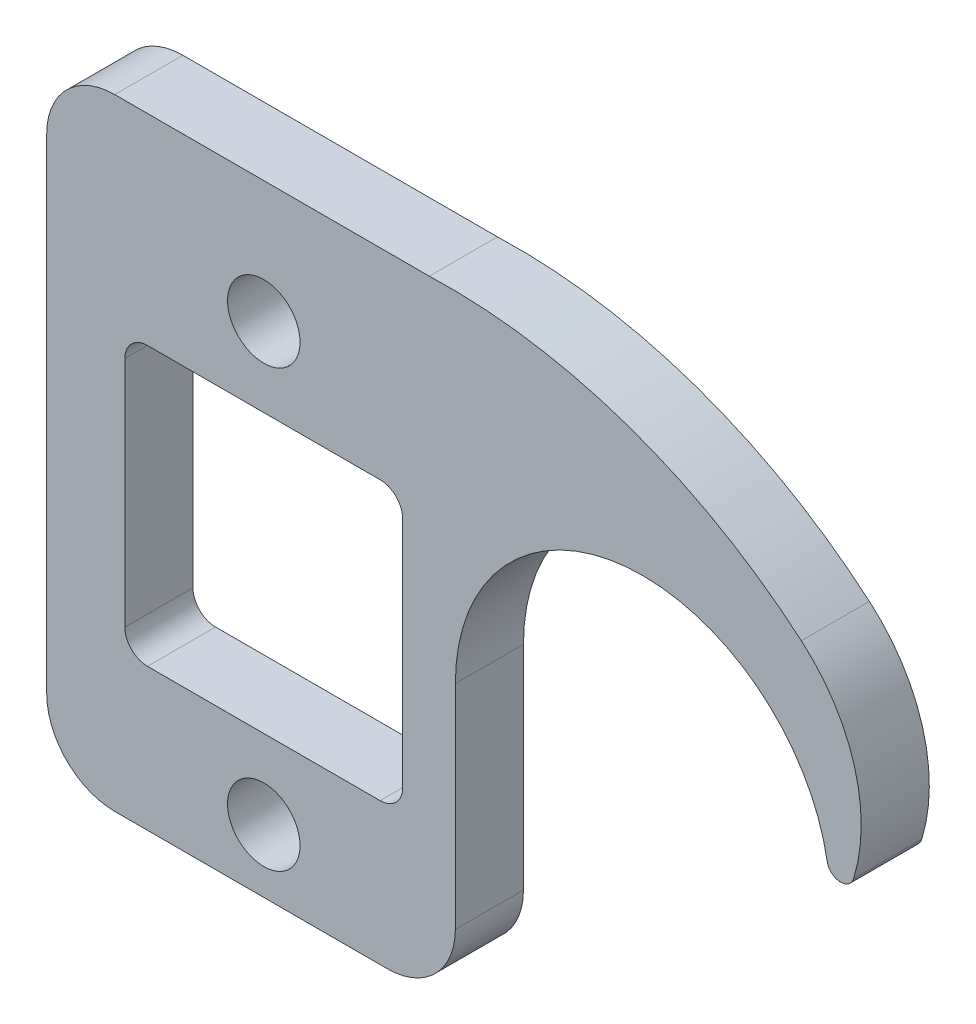
ISO-10303-21;
HEADER;
FILE_DESCRIPTION(('STEP AP214'),'2;1');
FILE_NAME('part.step','',(''),(''),'','','');
FILE_SCHEMA(('AUTOMOTIVE_DESIGN { 1 0 10303 214 1 1 1 1 }'));
ENDSEC;
DATA;
#1=APPLICATION_CONTEXT('core data for automotive mechanical design processes');
#2=APPLICATION_PROTOCOL_DEFINITION('international standard','automotive_design',2000,#1);
#3=PRODUCT_CONTEXT('',#1,'mechanical');
#4=PRODUCT('Part','Part','',(#3));
#5=PRODUCT_RELATED_PRODUCT_CATEGORY('part','',(#4));
#6=PRODUCT_DEFINITION_FORMATION('','',#4);
#7=PRODUCT_DEFINITION_CONTEXT('part definition',#1,'design');
#8=PRODUCT_DEFINITION('design','',#6,#7);
#9=PRODUCT_DEFINITION_SHAPE('','',#8);
#10=(LENGTH_UNIT() NAMED_UNIT(*) SI_UNIT(.MILLI.,.METRE.));
#11=(NAMED_UNIT(*) PLANE_ANGLE_UNIT() SI_UNIT($,.RADIAN.));
#12=(NAMED_UNIT(*) SI_UNIT($,.STERADIAN.) SOLID_ANGLE_UNIT());
#13=UNCERTAINTY_MEASURE_WITH_UNIT(LENGTH_MEASURE(1.E-05),#10,'distance_accuracy_value','');
#14=(GEOMETRIC_REPRESENTATION_CONTEXT(3) GLOBAL_UNCERTAINTY_ASSIGNED_CONTEXT((#13)) GLOBAL_UNIT_ASSIGNED_CONTEXT((#10,
#11,#12)) REPRESENTATION_CONTEXT('',''));
#15=CARTESIAN_POINT('',(0.,0.,0.));
#16=DIRECTION('',(0.,0.,1.));
#17=DIRECTION('',(1.,0.,0.));
#18=AXIS2_PLACEMENT_3D('',#15,#16,#17);
#19=CARTESIAN_POINT('',(-18.1389450946709,-19.0842207006165,94.2981249582492));
#20=DIRECTION('',(0.,0.,-1.));
#21=DIRECTION('',(-1.,0.,0.));
#22=AXIS2_PLACEMENT_3D('',#19,#20,#21);
#23=CYLINDRICAL_SURFACE('',#22,50.8);
#24=CARTESIAN_POINT('',(-18.1389450946709,-19.0842207006165,-3.175));
#25=DIRECTION('',(0.,0.,1.));
#26=DIRECTION('',(1.,0.,0.));
#27=AXIS2_PLACEMENT_3D('',#24,#25,#26);
#28=CIRCLE('',#27,50.8);
#29=CARTESIAN_POINT('',(14.7930990556582,19.595495793701,-3.175));
#30=VERTEX_POINT('',#29);
#31=CARTESIAN_POINT('',(-19.8857253584482,31.6857385145541,-3.175));
#32=VERTEX_POINT('',#31);
#33=EDGE_CURVE('E280',#30,#32,#28,.T.);
#34=ORIENTED_EDGE('',*,*,#33,.T.);
#35=DIRECTION('',(0.,0.,-1.));
#36=VECTOR('',#35,1.);
#37=CARTESIAN_POINT('',(-19.8857253584483,31.6857385145541,43.5889891098006));
#38=LINE('',#37,#36);
#39=CARTESIAN_POINT('',(-19.8857253584482,31.6857385145541,3.175));
#40=VERTEX_POINT('',#39);
#41=EDGE_CURVE('E355',#40,#32,#38,.T.);
#42=ORIENTED_EDGE('',*,*,#41,.F.);
#43=CARTESIAN_POINT('',(-18.1389450946709,-19.0842207006165,3.175));
#44=DIRECTION('',(0.,0.,1.));
#45=DIRECTION('',(1.,0.,0.));
#46=AXIS2_PLACEMENT_3D('',#43,#44,#45);
#47=CIRCLE('',#46,50.8);
#48=CARTESIAN_POINT('',(14.7930990556582,19.595495793701,3.175));
#49=VERTEX_POINT('',#48);
#50=EDGE_CURVE('E276',#40,#49,#47,.F.);
#51=ORIENTED_EDGE('',*,*,#50,.T.);
#52=DIRECTION('',(0.,0.,-1.));
#53=VECTOR('',#52,1.);
#54=CARTESIAN_POINT('',(14.7930990556582,19.595495793701,94.2981249582492));
#55=LINE('',#54,#53);
#56=EDGE_CURVE('E274',#49,#30,#55,.T.);
#57=ORIENTED_EDGE('',*,*,#56,.T.);
#58=EDGE_LOOP('',(#34,#42,#51,#57));
#59=FACE_BOUND('',#58,.T.);
#60=ADVANCED_FACE('F37',(#59),#23,.T.);
#61=CARTESIAN_POINT('',(4.50183525868039,7.5080843892268,3.175));
#62=DIRECTION('',(0.,0.,-1.));
#63=DIRECTION('',(-1.,0.,0.));
#64=AXIS2_PLACEMENT_3D('',#61,#62,#63);
#65=CYLINDRICAL_SURFACE('',#64,15.875);
#66=ORIENTED_EDGE('',*,*,#56,.F.);
#67=CARTESIAN_POINT('',(4.50183525868039,7.5080843892268,3.175));
#68=DIRECTION('',(0.,0.,1.));
#69=DIRECTION('',(1.,0.,0.));
#70=AXIS2_PLACEMENT_3D('',#67,#68,#69);
#71=CIRCLE('',#70,15.875);
#72=CARTESIAN_POINT('',(19.670597549428,2.82574783929873,3.175));
#73=VERTEX_POINT('',#72);
#74=EDGE_CURVE('E199',#73,#49,#71,.T.);
#75=ORIENTED_EDGE('',*,*,#74,.F.);
#76=DIRECTION('',(0.,0.,-1.));
#77=VECTOR('',#76,1.);
#78=CARTESIAN_POINT('',(19.670597549428,2.82574783929873,3.175));
#79=LINE('',#78,#77);
#80=CARTESIAN_POINT('',(19.670597549428,2.82574783929873,-3.175));
#81=VERTEX_POINT('',#80);
#82=EDGE_CURVE('E196',#73,#81,#79,.T.);
#83=ORIENTED_EDGE('',*,*,#82,.T.);
#84=CARTESIAN_POINT('',(4.50183525868039,7.5080843892268,-3.175));
#85=DIRECTION('',(0.,0.,1.));
#86=DIRECTION('',(1.,0.,0.));
#87=AXIS2_PLACEMENT_3D('',#84,#85,#86);
#88=CIRCLE('',#87,15.875);
#89=EDGE_CURVE('E206',#81,#30,#88,.T.);
#90=ORIENTED_EDGE('',*,*,#89,.T.);
#91=EDGE_LOOP('',(#66,#75,#83,#90));
#92=FACE_BOUND('',#91,.T.);
#93=ADVANCED_FACE('F288',(#92),#65,.T.);
#94=CARTESIAN_POINT('',(18.4570965661682,3.20033476329298,3.175));
#95=DIRECTION('',(0.,0.,-1.));
#96=DIRECTION('',(-1.,0.,0.));
#97=AXIS2_PLACEMENT_3D('',#94,#95,#96);
#98=CYLINDRICAL_SURFACE('',#97,1.27);
#99=CARTESIAN_POINT('',(18.4570965661682,3.20033476329298,-3.175));
#100=DIRECTION('',(0.,0.,1.));
#101=DIRECTION('',(1.,0.,0.));
#102=AXIS2_PLACEMENT_3D('',#99,#100,#101);
#103=CIRCLE('',#102,1.27);
#104=CARTESIAN_POINT('',(17.205767985411,2.98336291493413,-3.175));
#105=VERTEX_POINT('',#104);
#106=EDGE_CURVE('E203',#81,#105,#103,.F.);
#107=ORIENTED_EDGE('',*,*,#106,.F.);
#108=ORIENTED_EDGE('',*,*,#82,.F.);
#109=CARTESIAN_POINT('',(18.4570965661682,3.20033476329298,3.175));
#110=DIRECTION('',(0.,0.,1.));
#111=DIRECTION('',(1.,0.,0.));
#112=AXIS2_PLACEMENT_3D('',#109,#110,#111);
#113=CIRCLE('',#112,1.27);
#114=CARTESIAN_POINT('',(17.205767985411,2.98336291493413,3.175));
#115=VERTEX_POINT('',#114);
#116=EDGE_CURVE('E213',#73,#115,#113,.F.);
#117=ORIENTED_EDGE('',*,*,#116,.T.);
#118=DIRECTION('',(0.,0.,-1.));
#119=VECTOR('',#118,1.);
#120=CARTESIAN_POINT('',(17.205767985411,2.98336291493413,3.175));
#121=LINE('',#120,#119);
#122=EDGE_CURVE('E192',#115,#105,#121,.T.);
#123=ORIENTED_EDGE('',*,*,#122,.T.);
#124=EDGE_LOOP('',(#107,#108,#117,#123));
#125=FACE_BOUND('',#124,.T.);
#126=ADVANCED_FACE('F372',(#125),#98,.T.);
#127=CARTESIAN_POINT('',(-55.5625,0.,3.175));
#128=DIRECTION('',(-1.,0.,0.));
#129=DIRECTION('',(0.,-1.,0.));
#130=AXIS2_PLACEMENT_3D('',#127,#128,#129);
#131=PLANE('',#130);
#132=DIRECTION('',(0.,1.,0.));
#133=VECTOR('',#132,1.);
#134=CARTESIAN_POINT('',(-55.5625,0.,3.175));
#135=LINE('',#134,#133);
#136=CARTESIAN_POINT('',(-55.5625,-19.84375,3.175));
#137=VERTEX_POINT('',#136);
#138=CARTESIAN_POINT('',(-55.5625,25.3357385145541,3.175));
#139=VERTEX_POINT('',#138);
#140=EDGE_CURVE('E194',#137,#139,#135,.T.);
#141=ORIENTED_EDGE('',*,*,#140,.T.);
#142=DIRECTION('',(0.,0.,-1.));
#143=VECTOR('',#142,1.);
#144=CARTESIAN_POINT('',(-55.5625,25.3357385145541,-3.175));
#145=LINE('',#144,#143);
#146=CARTESIAN_POINT('',(-55.5625,25.3357385145541,-3.175));
#147=VERTEX_POINT('',#146);
#148=EDGE_CURVE('E250',#139,#147,#145,.T.);
#149=ORIENTED_EDGE('',*,*,#148,.T.);
#150=DIRECTION('',(0.,1.,0.));
#151=VECTOR('',#150,1.);
#152=CARTESIAN_POINT('',(-55.5625,0.,-3.175));
#153=LINE('',#152,#151);
#154=CARTESIAN_POINT('',(-55.5625,-19.84375,-3.175));
#155=VERTEX_POINT('',#154);
#156=EDGE_CURVE('E210',#155,#147,#153,.T.);
#157=ORIENTED_EDGE('',*,*,#156,.F.);
#158=DIRECTION('',(0.,0.,-1.));
#159=VECTOR('',#158,1.);
#160=CARTESIAN_POINT('',(-55.5625,-19.84375,3.175));
#161=LINE('',#160,#159);
#162=EDGE_CURVE('E221',#155,#137,#161,.F.);
#163=ORIENTED_EDGE('',*,*,#162,.T.);
#164=EDGE_LOOP('',(#141,#149,#157,#163));
#165=FACE_BOUND('',#164,.T.);
#166=ADVANCED_FACE('F256',(#165),#131,.T.);
#167=CARTESIAN_POINT('',(0.,0.,3.175));
#168=DIRECTION('',(0.,0.,-1.));
#169=DIRECTION('',(-1.,0.,0.));
#170=AXIS2_PLACEMENT_3D('',#167,#168,#169);
#171=CYLINDRICAL_SURFACE('',#170,17.4625);
#172=DIRECTION('',(0.,0.,1.));
#173=VECTOR('',#172,1.);
#174=CARTESIAN_POINT('',(-17.4625,-1.21939985759096E-13,-3.175));
#175=LINE('',#174,#173);
#176=CARTESIAN_POINT('',(-17.4625,-1.21939985759096E-13,-3.175));
#177=VERTEX_POINT('',#176);
#178=CARTESIAN_POINT('',(-17.4625,-1.21939985759096E-13,3.175));
#179=VERTEX_POINT('',#178);
#180=EDGE_CURVE('E182',#177,#179,#175,.T.);
#181=ORIENTED_EDGE('',*,*,#180,.F.);
#182=CARTESIAN_POINT('',(0.,0.,-3.175));
#183=DIRECTION('',(0.,0.,1.));
#184=DIRECTION('',(1.,0.,0.));
#185=AXIS2_PLACEMENT_3D('',#182,#183,#184);
#186=CIRCLE('',#185,17.4625);
#187=EDGE_CURVE('E212',#105,#177,#186,.T.);
#188=ORIENTED_EDGE('',*,*,#187,.F.);
#189=ORIENTED_EDGE('',*,*,#122,.F.);
#190=CARTESIAN_POINT('',(0.,0.,3.175));
#191=DIRECTION('',(0.,0.,1.));
#192=DIRECTION('',(1.,0.,0.));
#193=AXIS2_PLACEMENT_3D('',#190,#191,#192);
#194=CIRCLE('',#193,17.4625);
#195=EDGE_CURVE('E173',#115,#179,#194,.T.);
#196=ORIENTED_EDGE('',*,*,#195,.T.);
#197=EDGE_LOOP('',(#181,#188,#189,#196));
#198=FACE_BOUND('',#197,.T.);
#199=ADVANCED_FACE('F191',(#198),#171,.F.);
#200=CARTESIAN_POINT('',(0.,0.,3.175));
#201=DIRECTION('',(0.,0.,1.));
#202=DIRECTION('',(1.,0.,0.));
#203=AXIS2_PLACEMENT_3D('',#200,#201,#202);
#204=PLANE('',#203);
#205=DIRECTION('',(-1.,0.,0.));
#206=VECTOR('',#205,1.);
#207=CARTESIAN_POINT('',(-19.8857253584483,31.6857385145541,3.175));
#208=LINE('',#207,#206);
#209=CARTESIAN_POINT('',(-49.2125,31.6857385145541,3.175));
#210=VERTEX_POINT('',#209);
#211=EDGE_CURVE('E179',#40,#210,#208,.T.);
#212=ORIENTED_EDGE('',*,*,#211,.T.);
#213=CARTESIAN_POINT('',(-49.2125,25.3357385145541,3.175));
#214=DIRECTION('',(0.,0.,1.));
#215=DIRECTION('',(1.,0.,0.));
#216=AXIS2_PLACEMENT_3D('',#213,#214,#215);
#217=CIRCLE('',#216,6.35);
#218=EDGE_CURVE('E11',#210,#139,#217,.T.);
#219=ORIENTED_EDGE('',*,*,#218,.T.);
#220=ORIENTED_EDGE('',*,*,#140,.F.);
#221=CARTESIAN_POINT('',(-49.2125,-19.84375,3.175));
#222=DIRECTION('',(0.,0.,1.));
#223=DIRECTION('',(1.,0.,0.));
#224=AXIS2_PLACEMENT_3D('',#221,#222,#223);
#225=CIRCLE('',#224,6.35);
#226=CARTESIAN_POINT('',(-49.2125,-26.19375,3.175));
#227=VERTEX_POINT('',#226);
#228=EDGE_CURVE('E223',#137,#227,#225,.T.);
#229=ORIENTED_EDGE('',*,*,#228,.T.);
#230=DIRECTION('',(1.,0.,0.));
#231=VECTOR('',#230,1.);
#232=CARTESIAN_POINT('',(0.,-26.19375,3.175));
#233=LINE('',#232,#231);
#234=CARTESIAN_POINT('',(-23.8125,-26.19375,3.175));
#235=VERTEX_POINT('',#234);
#236=EDGE_CURVE('E207',#227,#235,#233,.T.);
#237=ORIENTED_EDGE('',*,*,#236,.T.);
#238=CARTESIAN_POINT('',(-23.8125,-19.84375,3.175));
#239=DIRECTION('',(0.,0.,1.));
#240=DIRECTION('',(1.,0.,0.));
#241=AXIS2_PLACEMENT_3D('',#238,#239,#240);
#242=CIRCLE('',#241,6.35);
#243=CARTESIAN_POINT('',(-17.4625,-19.84375,3.175));
#244=VERTEX_POINT('',#243);
#245=EDGE_CURVE('E175',#235,#244,#242,.T.);
#246=ORIENTED_EDGE('',*,*,#245,.T.);
#247=DIRECTION('',(0.,1.,0.));
#248=VECTOR('',#247,1.);
#249=CARTESIAN_POINT('',(-17.4625,-1.21939985759096E-13,3.175));
#250=LINE('',#249,#248);
#251=EDGE_CURVE('E167',#244,#179,#250,.T.);
#252=ORIENTED_EDGE('',*,*,#251,.T.);
#253=ORIENTED_EDGE('',*,*,#195,.F.);
#254=ORIENTED_EDGE('',*,*,#116,.F.);
#255=ORIENTED_EDGE('',*,*,#74,.T.);
#256=ORIENTED_EDGE('',*,*,#50,.F.);
#257=EDGE_LOOP('',(#212,#219,#220,#229,#237,#246,#252,#253,#254,#255,#256));
#258=FACE_BOUND('',#257,.T.);
#259=CARTESIAN_POINT('',(-46.167675,-10.8458,3.175));
#260=DIRECTION('',(0.,0.,1.));
#261=DIRECTION('',(1.,0.,0.));
#262=AXIS2_PLACEMENT_3D('',#259,#260,#261);
#263=CIRCLE('',#262,2.1082);
#264=CARTESIAN_POINT('',(-48.275875,-10.8458,3.175));
#265=VERTEX_POINT('',#264);
#266=CARTESIAN_POINT('',(-46.167675,-12.954,3.175));
#267=VERTEX_POINT('',#266);
#268=EDGE_CURVE('E189',#265,#267,#263,.T.);
#269=ORIENTED_EDGE('',*,*,#268,.F.);
#270=DIRECTION('',(0.,1.,0.));
#271=VECTOR('',#270,1.);
#272=CARTESIAN_POINT('',(-48.275875,-10.8458,3.175));
#273=LINE('',#272,#271);
#274=CARTESIAN_POINT('',(-48.275875,10.8458,3.175));
#275=VERTEX_POINT('',#274);
#276=EDGE_CURVE('E239',#275,#265,#273,.F.);
#277=ORIENTED_EDGE('',*,*,#276,.F.);
#278=CARTESIAN_POINT('',(-46.167675,10.8458,3.175));
#279=DIRECTION('',(0.,0.,1.));
#280=DIRECTION('',(1.,0.,0.));
#281=AXIS2_PLACEMENT_3D('',#278,#279,#280);
#282=CIRCLE('',#281,2.1082);
#283=CARTESIAN_POINT('',(-46.167675,12.954,3.175));
#284=VERTEX_POINT('',#283);
#285=EDGE_CURVE('E237',#284,#275,#282,.T.);
#286=ORIENTED_EDGE('',*,*,#285,.F.);
#287=DIRECTION('',(1.,0.,0.));
#288=VECTOR('',#287,1.);
#289=CARTESIAN_POINT('',(-46.167675,12.954,3.175));
#290=LINE('',#289,#288);
#291=CARTESIAN_POINT('',(-24.476075,12.954,3.175));
#292=VERTEX_POINT('',#291);
#293=EDGE_CURVE('E235',#292,#284,#290,.F.);
#294=ORIENTED_EDGE('',*,*,#293,.F.);
#295=CARTESIAN_POINT('',(-24.476075,10.8458,3.175));
#296=DIRECTION('',(0.,0.,1.));
#297=DIRECTION('',(1.,0.,0.));
#298=AXIS2_PLACEMENT_3D('',#295,#296,#297);
#299=CIRCLE('',#298,2.1082);
#300=CARTESIAN_POINT('',(-22.367875,10.8458,3.175));
#301=VERTEX_POINT('',#300);
#302=EDGE_CURVE('E233',#301,#292,#299,.T.);
#303=ORIENTED_EDGE('',*,*,#302,.F.);
#304=DIRECTION('',(0.,1.,0.));
#305=VECTOR('',#304,1.);
#306=CARTESIAN_POINT('',(-22.367875,-10.8458,3.175));
#307=LINE('',#306,#305);
#308=CARTESIAN_POINT('',(-22.367875,-10.8458,3.175));
#309=VERTEX_POINT('',#308);
#310=EDGE_CURVE('E231',#309,#301,#307,.T.);
#311=ORIENTED_EDGE('',*,*,#310,.F.);
#312=CARTESIAN_POINT('',(-24.476075,-10.8458,3.175));
#313=DIRECTION('',(0.,0.,1.));
#314=DIRECTION('',(1.,0.,0.));
#315=AXIS2_PLACEMENT_3D('',#312,#313,#314);
#316=CIRCLE('',#315,2.1082);
#317=CARTESIAN_POINT('',(-24.476075,-12.954,3.175));
#318=VERTEX_POINT('',#317);
#319=EDGE_CURVE('E228',#318,#309,#316,.T.);
#320=ORIENTED_EDGE('',*,*,#319,.F.);
#321=DIRECTION('',(1.,0.,0.));
#322=VECTOR('',#321,1.);
#323=CARTESIAN_POINT('',(-46.167675,-12.954,3.175));
#324=LINE('',#323,#322);
#325=EDGE_CURVE('E226',#267,#318,#324,.T.);
#326=ORIENTED_EDGE('',*,*,#325,.F.);
#327=EDGE_LOOP('',(#269,#277,#286,#294,#303,#311,#320,#326));
#328=FACE_BOUND('',#327,.T.);
#329=CARTESIAN_POINT('',(-35.321875,-20.32,3.175));
#330=DIRECTION('',(0.,0.,1.));
#331=DIRECTION('',(1.,0.,0.));
#332=AXIS2_PLACEMENT_3D('',#329,#330,#331);
#333=CIRCLE('',#332,3.3782);
#334=CARTESIAN_POINT('',(-31.943675,-20.32,3.175));
#335=VERTEX_POINT('',#334);
#336=EDGE_CURVE('E298',#335,#335,#333,.T.);
#337=ORIENTED_EDGE('',*,*,#336,.F.);
#338=EDGE_LOOP('',(#337));
#339=FACE_BOUND('',#338,.T.);
#340=CARTESIAN_POINT('',(-35.321875,20.32,3.175));
#341=DIRECTION('',(0.,0.,1.));
#342=DIRECTION('',(1.,0.,0.));
#343=AXIS2_PLACEMENT_3D('',#340,#341,#342);
#344=CIRCLE('',#343,3.3782);
#345=CARTESIAN_POINT('',(-31.943675,20.32,3.175));
#346=VERTEX_POINT('',#345);
#347=EDGE_CURVE('E296',#346,#346,#344,.T.);
#348=ORIENTED_EDGE('',*,*,#347,.F.);
#349=EDGE_LOOP('',(#348));
#350=FACE_BOUND('',#349,.T.);
#351=ADVANCED_FACE('F169',(#258,#328,#339,#350),#204,.T.);
#352=CARTESIAN_POINT('',(0.,0.,-3.175));
#353=DIRECTION('',(0.,0.,1.));
#354=DIRECTION('',(1.,0.,0.));
#355=AXIS2_PLACEMENT_3D('',#352,#353,#354);
#356=PLANE('',#355);
#357=ORIENTED_EDGE('',*,*,#156,.T.);
#358=CARTESIAN_POINT('',(-49.2125,25.3357385145541,-3.175));
#359=DIRECTION('',(0.,0.,1.));
#360=DIRECTION('',(1.,0.,0.));
#361=AXIS2_PLACEMENT_3D('',#358,#359,#360);
#362=CIRCLE('',#361,6.35);
#363=CARTESIAN_POINT('',(-49.2125,31.6857385145541,-3.175));
#364=VERTEX_POINT('',#363);
#365=EDGE_CURVE('E59',#147,#364,#362,.F.);
#366=ORIENTED_EDGE('',*,*,#365,.T.);
#367=DIRECTION('',(1.,0.,0.));
#368=VECTOR('',#367,1.);
#369=CARTESIAN_POINT('',(-19.8857253584483,31.6857385145541,-3.175));
#370=LINE('',#369,#368);
#371=EDGE_CURVE('E295',#364,#32,#370,.T.);
#372=ORIENTED_EDGE('',*,*,#371,.T.);
#373=ORIENTED_EDGE('',*,*,#33,.F.);
#374=ORIENTED_EDGE('',*,*,#89,.F.);
#375=ORIENTED_EDGE('',*,*,#106,.T.);
#376=ORIENTED_EDGE('',*,*,#187,.T.);
#377=DIRECTION('',(0.,-1.,0.));
#378=VECTOR('',#377,1.);
#379=CARTESIAN_POINT('',(-17.4625,-1.21939985759096E-13,-3.175));
#380=LINE('',#379,#378);
#381=CARTESIAN_POINT('',(-17.4625,-19.84375,-3.175));
#382=VERTEX_POINT('',#381);
#383=EDGE_CURVE('E178',#177,#382,#380,.T.);
#384=ORIENTED_EDGE('',*,*,#383,.T.);
#385=CARTESIAN_POINT('',(-23.8125,-19.84375,-3.175));
#386=DIRECTION('',(0.,0.,1.));
#387=DIRECTION('',(1.,0.,0.));
#388=AXIS2_PLACEMENT_3D('',#385,#386,#387);
#389=CIRCLE('',#388,6.35);
#390=CARTESIAN_POINT('',(-23.8125,-26.19375,-3.175));
#391=VERTEX_POINT('',#390);
#392=EDGE_CURVE('E248',#382,#391,#389,.F.);
#393=ORIENTED_EDGE('',*,*,#392,.T.);
#394=DIRECTION('',(-1.,0.,0.));
#395=VECTOR('',#394,1.);
#396=CARTESIAN_POINT('',(0.,-26.19375,-3.175));
#397=LINE('',#396,#395);
#398=CARTESIAN_POINT('',(-49.2125,-26.19375,-3.175));
#399=VERTEX_POINT('',#398);
#400=EDGE_CURVE('E265',#391,#399,#397,.T.);
#401=ORIENTED_EDGE('',*,*,#400,.T.);
#402=CARTESIAN_POINT('',(-49.2125,-19.84375,-3.175));
#403=DIRECTION('',(0.,0.,1.));
#404=DIRECTION('',(1.,0.,0.));
#405=AXIS2_PLACEMENT_3D('',#402,#403,#404);
#406=CIRCLE('',#405,6.35);
#407=EDGE_CURVE('E219',#399,#155,#406,.F.);
#408=ORIENTED_EDGE('',*,*,#407,.T.);
#409=EDGE_LOOP('',(#357,#366,#372,#373,#374,#375,#376,#384,#393,#401,#408));
#410=FACE_BOUND('',#409,.T.);
#411=CARTESIAN_POINT('',(-35.321875,20.32,-3.175));
#412=DIRECTION('',(0.,0.,1.));
#413=DIRECTION('',(1.,0.,0.));
#414=AXIS2_PLACEMENT_3D('',#411,#412,#413);
#415=CIRCLE('',#414,3.3782);
#416=CARTESIAN_POINT('',(-31.943675,20.32,-3.175));
#417=VERTEX_POINT('',#416);
#418=EDGE_CURVE('E303',#417,#417,#415,.T.);
#419=ORIENTED_EDGE('',*,*,#418,.T.);
#420=EDGE_LOOP('',(#419));
#421=FACE_BOUND('',#420,.T.);
#422=CARTESIAN_POINT('',(-35.321875,-20.32,-3.175));
#423=DIRECTION('',(0.,0.,1.));
#424=DIRECTION('',(-1.,0.,0.));
#425=AXIS2_PLACEMENT_3D('',#422,#423,#424);
#426=CIRCLE('',#425,3.3782);
#427=CARTESIAN_POINT('',(-38.700075,-20.32,-3.175));
#428=VERTEX_POINT('',#427);
#429=EDGE_CURVE('E188',#428,#428,#426,.T.);
#430=ORIENTED_EDGE('',*,*,#429,.T.);
#431=EDGE_LOOP('',(#430));
#432=FACE_BOUND('',#431,.T.);
#433=DIRECTION('',(0.,-1.,0.));
#434=VECTOR('',#433,1.);
#435=CARTESIAN_POINT('',(-48.275875,-10.8458,-3.175));
#436=LINE('',#435,#434);
#437=CARTESIAN_POINT('',(-48.275875,10.8458,-3.175));
#438=VERTEX_POINT('',#437);
#439=CARTESIAN_POINT('',(-48.275875,-10.8458,-3.175));
#440=VERTEX_POINT('',#439);
#441=EDGE_CURVE('E326',#438,#440,#436,.T.);
#442=ORIENTED_EDGE('',*,*,#441,.T.);
#443=CARTESIAN_POINT('',(-46.167675,-10.8458,-3.175));
#444=DIRECTION('',(0.,0.,1.));
#445=DIRECTION('',(-1.,0.,0.));
#446=AXIS2_PLACEMENT_3D('',#443,#444,#445);
#447=CIRCLE('',#446,2.1082);
#448=CARTESIAN_POINT('',(-46.167675,-12.954,-3.175));
#449=VERTEX_POINT('',#448);
#450=EDGE_CURVE('E351',#440,#449,#447,.T.);
#451=ORIENTED_EDGE('',*,*,#450,.T.);
#452=DIRECTION('',(1.,0.,0.));
#453=VECTOR('',#452,1.);
#454=CARTESIAN_POINT('',(-46.167675,-12.954,-3.175));
#455=LINE('',#454,#453);
#456=CARTESIAN_POINT('',(-24.476075,-12.954,-3.175));
#457=VERTEX_POINT('',#456);
#458=EDGE_CURVE('E348',#449,#457,#455,.T.);
#459=ORIENTED_EDGE('',*,*,#458,.T.);
#460=CARTESIAN_POINT('',(-24.476075,-10.8458,-3.175));
#461=DIRECTION('',(0.,0.,1.));
#462=DIRECTION('',(1.,0.,0.));
#463=AXIS2_PLACEMENT_3D('',#460,#461,#462);
#464=CIRCLE('',#463,2.1082);
#465=CARTESIAN_POINT('',(-22.367875,-10.8458,-3.175));
#466=VERTEX_POINT('',#465);
#467=EDGE_CURVE('E345',#457,#466,#464,.T.);
#468=ORIENTED_EDGE('',*,*,#467,.T.);
#469=DIRECTION('',(0.,1.,0.));
#470=VECTOR('',#469,1.);
#471=CARTESIAN_POINT('',(-22.367875,-10.8458,-3.175));
#472=LINE('',#471,#470);
#473=CARTESIAN_POINT('',(-22.367875,10.8458,-3.175));
#474=VERTEX_POINT('',#473);
#475=EDGE_CURVE('E342',#466,#474,#472,.T.);
#476=ORIENTED_EDGE('',*,*,#475,.T.);
#477=CARTESIAN_POINT('',(-24.476075,10.8458,-3.175));
#478=DIRECTION('',(0.,0.,1.));
#479=DIRECTION('',(-1.,0.,0.));
#480=AXIS2_PLACEMENT_3D('',#477,#478,#479);
#481=CIRCLE('',#480,2.1082);
#482=CARTESIAN_POINT('',(-24.476075,12.954,-3.175));
#483=VERTEX_POINT('',#482);
#484=EDGE_CURVE('E339',#474,#483,#481,.T.);
#485=ORIENTED_EDGE('',*,*,#484,.T.);
#486=DIRECTION('',(-1.,0.,0.));
#487=VECTOR('',#486,1.);
#488=CARTESIAN_POINT('',(-46.167675,12.954,-3.175));
#489=LINE('',#488,#487);
#490=CARTESIAN_POINT('',(-46.167675,12.954,-3.175));
#491=VERTEX_POINT('',#490);
#492=EDGE_CURVE('E336',#483,#491,#489,.T.);
#493=ORIENTED_EDGE('',*,*,#492,.T.);
#494=CARTESIAN_POINT('',(-46.167675,10.8458,-3.175));
#495=DIRECTION('',(0.,0.,1.));
#496=DIRECTION('',(-1.,0.,0.));
#497=AXIS2_PLACEMENT_3D('',#494,#495,#496);
#498=CIRCLE('',#497,2.1082);
#499=EDGE_CURVE('E333',#491,#438,#498,.T.);
#500=ORIENTED_EDGE('',*,*,#499,.T.);
#501=EDGE_LOOP('',(#442,#451,#459,#468,#476,#485,#493,#500));
#502=FACE_BOUND('',#501,.T.);
#503=ADVANCED_FACE('F261',(#410,#421,#432,#502),#356,.F.);
#504=CARTESIAN_POINT('',(0.,-26.19375,94.2981249582492));
#505=DIRECTION('',(0.,1.,0.));
#506=DIRECTION('',(0.,0.,1.));
#507=AXIS2_PLACEMENT_3D('',#504,#505,#506);
#508=PLANE('',#507);
#509=ORIENTED_EDGE('',*,*,#400,.F.);
#510=DIRECTION('',(0.,0.,1.));
#511=VECTOR('',#510,1.);
#512=CARTESIAN_POINT('',(-23.8125,-26.19375,3.175));
#513=LINE('',#512,#511);
#514=EDGE_CURVE('E225',#391,#235,#513,.T.);
#515=ORIENTED_EDGE('',*,*,#514,.T.);
#516=ORIENTED_EDGE('',*,*,#236,.F.);
#517=DIRECTION('',(0.,0.,-1.));
#518=VECTOR('',#517,1.);
#519=CARTESIAN_POINT('',(-49.2125,-26.19375,-3.175));
#520=LINE('',#519,#518);
#521=EDGE_CURVE('E216',#227,#399,#520,.T.);
#522=ORIENTED_EDGE('',*,*,#521,.T.);
#523=EDGE_LOOP('',(#509,#515,#516,#522));
#524=FACE_BOUND('',#523,.T.);
#525=ADVANCED_FACE('F272',(#524),#508,.F.);
#526=CARTESIAN_POINT('',(-35.321875,-20.32,-3.175));
#527=DIRECTION('',(0.,0.,1.));
#528=DIRECTION('',(1.,0.,0.));
#529=AXIS2_PLACEMENT_3D('',#526,#527,#528);
#530=CYLINDRICAL_SURFACE('',#529,3.3782);
#531=ORIENTED_EDGE('',*,*,#336,.T.);
#532=EDGE_LOOP('',(#531));
#533=FACE_BOUND('',#532,.T.);
#534=ORIENTED_EDGE('',*,*,#429,.F.);
#535=EDGE_LOOP('',(#534));
#536=FACE_BOUND('',#535,.T.);
#537=ADVANCED_FACE('F433',(#533,#536),#530,.F.);
#538=CARTESIAN_POINT('',(-35.321875,20.32,-3.175));
#539=DIRECTION('',(0.,0.,1.));
#540=DIRECTION('',(1.,0.,0.));
#541=AXIS2_PLACEMENT_3D('',#538,#539,#540);
#542=CYLINDRICAL_SURFACE('',#541,3.3782);
#543=ORIENTED_EDGE('',*,*,#347,.T.);
#544=EDGE_LOOP('',(#543));
#545=FACE_BOUND('',#544,.T.);
#546=ORIENTED_EDGE('',*,*,#418,.F.);
#547=EDGE_LOOP('',(#546));
#548=FACE_BOUND('',#547,.T.);
#549=ADVANCED_FACE('F390',(#545,#548),#542,.F.);
#550=CARTESIAN_POINT('',(-49.2125,-19.84375,94.2981249582492));
#551=DIRECTION('',(0.,0.,1.));
#552=DIRECTION('',(1.,0.,0.));
#553=AXIS2_PLACEMENT_3D('',#550,#551,#552);
#554=CYLINDRICAL_SURFACE('',#553,6.35);
#555=ORIENTED_EDGE('',*,*,#228,.F.);
#556=ORIENTED_EDGE('',*,*,#162,.F.);
#557=ORIENTED_EDGE('',*,*,#407,.F.);
#558=ORIENTED_EDGE('',*,*,#521,.F.);
#559=EDGE_LOOP('',(#555,#556,#557,#558));
#560=FACE_BOUND('',#559,.T.);
#561=ADVANCED_FACE('F269',(#560),#554,.T.);
#562=CARTESIAN_POINT('',(-46.167675,-10.8458,-3.175));
#563=DIRECTION('',(0.,0.,1.));
#564=DIRECTION('',(1.,0.,0.));
#565=AXIS2_PLACEMENT_3D('',#562,#563,#564);
#566=CYLINDRICAL_SURFACE('',#565,2.1082);
#567=ORIENTED_EDGE('',*,*,#268,.T.);
#568=DIRECTION('',(0.,0.,1.));
#569=VECTOR('',#568,1.);
#570=CARTESIAN_POINT('',(-46.167675,-12.954,-3.175));
#571=LINE('',#570,#569);
#572=EDGE_CURVE('E312',#449,#267,#571,.T.);
#573=ORIENTED_EDGE('',*,*,#572,.F.);
#574=ORIENTED_EDGE('',*,*,#450,.F.);
#575=DIRECTION('',(0.,0.,1.));
#576=VECTOR('',#575,1.);
#577=CARTESIAN_POINT('',(-48.275875,-10.8458,-3.175));
#578=LINE('',#577,#576);
#579=EDGE_CURVE('E229',#440,#265,#578,.T.);
#580=ORIENTED_EDGE('',*,*,#579,.T.);
#581=EDGE_LOOP('',(#567,#573,#574,#580));
#582=FACE_BOUND('',#581,.T.);
#583=ADVANCED_FACE('F389',(#582),#566,.F.);
#584=CARTESIAN_POINT('',(-48.275875,-10.8458,-3.175));
#585=DIRECTION('',(-1.,0.,0.));
#586=DIRECTION('',(0.,0.,1.));
#587=AXIS2_PLACEMENT_3D('',#584,#585,#586);
#588=PLANE('',#587);
#589=ORIENTED_EDGE('',*,*,#276,.T.);
#590=ORIENTED_EDGE('',*,*,#579,.F.);
#591=ORIENTED_EDGE('',*,*,#441,.F.);
#592=DIRECTION('',(0.,0.,1.));
#593=VECTOR('',#592,1.);
#594=CARTESIAN_POINT('',(-48.275875,10.8458,-3.175));
#595=LINE('',#594,#593);
#596=EDGE_CURVE('E324',#438,#275,#595,.T.);
#597=ORIENTED_EDGE('',*,*,#596,.T.);
#598=EDGE_LOOP('',(#589,#590,#591,#597));
#599=FACE_BOUND('',#598,.T.);
#600=ADVANCED_FACE('F406',(#599),#588,.F.);
#601=CARTESIAN_POINT('',(-46.167675,10.8458,-3.175));
#602=DIRECTION('',(0.,0.,1.));
#603=DIRECTION('',(1.,0.,0.));
#604=AXIS2_PLACEMENT_3D('',#601,#602,#603);
#605=CYLINDRICAL_SURFACE('',#604,2.1082);
#606=ORIENTED_EDGE('',*,*,#285,.T.);
#607=ORIENTED_EDGE('',*,*,#596,.F.);
#608=ORIENTED_EDGE('',*,*,#499,.F.);
#609=DIRECTION('',(0.,0.,1.));
#610=VECTOR('',#609,1.);
#611=CARTESIAN_POINT('',(-46.167675,12.954,-3.175));
#612=LINE('',#611,#610);
#613=EDGE_CURVE('E321',#491,#284,#612,.T.);
#614=ORIENTED_EDGE('',*,*,#613,.T.);
#615=EDGE_LOOP('',(#606,#607,#608,#614));
#616=FACE_BOUND('',#615,.T.);
#617=ADVANCED_FACE('F409',(#616),#605,.F.);
#618=CARTESIAN_POINT('',(-46.167675,12.954,-3.175));
#619=DIRECTION('',(0.,1.,0.));
#620=DIRECTION('',(0.,0.,1.));
#621=AXIS2_PLACEMENT_3D('',#618,#619,#620);
#622=PLANE('',#621);
#623=ORIENTED_EDGE('',*,*,#293,.T.);
#624=ORIENTED_EDGE('',*,*,#613,.F.);
#625=ORIENTED_EDGE('',*,*,#492,.F.);
#626=DIRECTION('',(0.,0.,1.));
#627=VECTOR('',#626,1.);
#628=CARTESIAN_POINT('',(-24.476075,12.954,-3.175));
#629=LINE('',#628,#627);
#630=EDGE_CURVE('E318',#483,#292,#629,.T.);
#631=ORIENTED_EDGE('',*,*,#630,.T.);
#632=EDGE_LOOP('',(#623,#624,#625,#631));
#633=FACE_BOUND('',#632,.T.);
#634=ADVANCED_FACE('F413',(#633),#622,.F.);
#635=CARTESIAN_POINT('',(-24.476075,10.8458,-3.175));
#636=DIRECTION('',(0.,0.,1.));
#637=DIRECTION('',(1.,0.,0.));
#638=AXIS2_PLACEMENT_3D('',#635,#636,#637);
#639=CYLINDRICAL_SURFACE('',#638,2.1082);
#640=ORIENTED_EDGE('',*,*,#302,.T.);
#641=ORIENTED_EDGE('',*,*,#630,.F.);
#642=ORIENTED_EDGE('',*,*,#484,.F.);
#643=DIRECTION('',(0.,0.,1.));
#644=VECTOR('',#643,1.);
#645=CARTESIAN_POINT('',(-22.367875,10.8458,-3.175));
#646=LINE('',#645,#644);
#647=EDGE_CURVE('E315',#474,#301,#646,.T.);
#648=ORIENTED_EDGE('',*,*,#647,.T.);
#649=EDGE_LOOP('',(#640,#641,#642,#648));
#650=FACE_BOUND('',#649,.T.);
#651=ADVANCED_FACE('F417',(#650),#639,.F.);
#652=CARTESIAN_POINT('',(-22.367875,-10.8458,-3.175));
#653=DIRECTION('',(1.,0.,0.));
#654=DIRECTION('',(0.,0.,-1.));
#655=AXIS2_PLACEMENT_3D('',#652,#653,#654);
#656=PLANE('',#655);
#657=ORIENTED_EDGE('',*,*,#310,.T.);
#658=ORIENTED_EDGE('',*,*,#647,.F.);
#659=ORIENTED_EDGE('',*,*,#475,.F.);
#660=DIRECTION('',(0.,0.,1.));
#661=VECTOR('',#660,1.);
#662=CARTESIAN_POINT('',(-22.367875,-10.8458,-3.175));
#663=LINE('',#662,#661);
#664=EDGE_CURVE('E311',#466,#309,#663,.T.);
#665=ORIENTED_EDGE('',*,*,#664,.T.);
#666=EDGE_LOOP('',(#657,#658,#659,#665));
#667=FACE_BOUND('',#666,.T.);
#668=ADVANCED_FACE('F421',(#667),#656,.F.);
#669=CARTESIAN_POINT('',(-24.476075,-10.8458,-3.175));
#670=DIRECTION('',(0.,0.,1.));
#671=DIRECTION('',(1.,0.,0.));
#672=AXIS2_PLACEMENT_3D('',#669,#670,#671);
#673=CYLINDRICAL_SURFACE('',#672,2.1082);
#674=ORIENTED_EDGE('',*,*,#319,.T.);
#675=ORIENTED_EDGE('',*,*,#664,.F.);
#676=ORIENTED_EDGE('',*,*,#467,.F.);
#677=DIRECTION('',(0.,0.,1.));
#678=VECTOR('',#677,1.);
#679=CARTESIAN_POINT('',(-24.476075,-12.954,-3.175));
#680=LINE('',#679,#678);
#681=EDGE_CURVE('E308',#457,#318,#680,.T.);
#682=ORIENTED_EDGE('',*,*,#681,.T.);
#683=EDGE_LOOP('',(#674,#675,#676,#682));
#684=FACE_BOUND('',#683,.T.);
#685=ADVANCED_FACE('F402',(#684),#673,.F.);
#686=CARTESIAN_POINT('',(-46.167675,-12.954,-3.175));
#687=DIRECTION('',(0.,-1.,0.));
#688=DIRECTION('',(0.,0.,-1.));
#689=AXIS2_PLACEMENT_3D('',#686,#687,#688);
#690=PLANE('',#689);
#691=ORIENTED_EDGE('',*,*,#325,.T.);
#692=ORIENTED_EDGE('',*,*,#681,.F.);
#693=ORIENTED_EDGE('',*,*,#458,.F.);
#694=ORIENTED_EDGE('',*,*,#572,.T.);
#695=EDGE_LOOP('',(#691,#692,#693,#694));
#696=FACE_BOUND('',#695,.T.);
#697=ADVANCED_FACE('F396',(#696),#690,.F.);
#698=CARTESIAN_POINT('',(-17.4625,-1.21939985759096E-13,-30.8037714095634));
#699=DIRECTION('',(1.,0.,0.));
#700=DIRECTION('',(0.,0.,-1.));
#701=AXIS2_PLACEMENT_3D('',#698,#699,#700);
#702=PLANE('',#701);
#703=ORIENTED_EDGE('',*,*,#251,.F.);
#704=DIRECTION('',(0.,0.,1.));
#705=VECTOR('',#704,1.);
#706=CARTESIAN_POINT('',(-17.4625,-19.84375,-3.175));
#707=LINE('',#706,#705);
#708=EDGE_CURVE('E246',#244,#382,#707,.F.);
#709=ORIENTED_EDGE('',*,*,#708,.T.);
#710=ORIENTED_EDGE('',*,*,#383,.F.);
#711=ORIENTED_EDGE('',*,*,#180,.T.);
#712=EDGE_LOOP('',(#703,#709,#710,#711));
#713=FACE_BOUND('',#712,.T.);
#714=ADVANCED_FACE('F183',(#713),#702,.T.);
#715=CARTESIAN_POINT('',(-23.8125,-19.84375,94.2981249582492));
#716=DIRECTION('',(0.,0.,-1.));
#717=DIRECTION('',(-1.,0.,0.));
#718=AXIS2_PLACEMENT_3D('',#715,#716,#717);
#719=CYLINDRICAL_SURFACE('',#718,6.35);
#720=ORIENTED_EDGE('',*,*,#392,.F.);
#721=ORIENTED_EDGE('',*,*,#708,.F.);
#722=ORIENTED_EDGE('',*,*,#245,.F.);
#723=ORIENTED_EDGE('',*,*,#514,.F.);
#724=EDGE_LOOP('',(#720,#721,#722,#723));
#725=FACE_BOUND('',#724,.T.);
#726=ADVANCED_FACE('F363',(#725),#719,.T.);
#727=CARTESIAN_POINT('',(-19.8857253584483,31.6857385145541,43.5889891098006));
#728=DIRECTION('',(0.,-1.,0.));
#729=DIRECTION('',(1.,0.,0.));
#730=AXIS2_PLACEMENT_3D('',#727,#728,#729);
#731=PLANE('',#730);
#732=ORIENTED_EDGE('',*,*,#371,.F.);
#733=DIRECTION('',(0.,0.,-1.));
#734=VECTOR('',#733,1.);
#735=CARTESIAN_POINT('',(-49.2125,31.6857385145541,3.175));
#736=LINE('',#735,#734);
#737=EDGE_CURVE('E45',#364,#210,#736,.F.);
#738=ORIENTED_EDGE('',*,*,#737,.T.);
#739=ORIENTED_EDGE('',*,*,#211,.F.);
#740=ORIENTED_EDGE('',*,*,#41,.T.);
#741=EDGE_LOOP('',(#732,#738,#739,#740));
#742=FACE_BOUND('',#741,.T.);
#743=ADVANCED_FACE('F359',(#742),#731,.F.);
#744=CARTESIAN_POINT('',(-49.2125,25.3357385145541,3.175));
#745=DIRECTION('',(0.,0.,1.));
#746=DIRECTION('',(1.,0.,0.));
#747=AXIS2_PLACEMENT_3D('',#744,#745,#746);
#748=CYLINDRICAL_SURFACE('',#747,6.35);
#749=ORIENTED_EDGE('',*,*,#218,.F.);
#750=ORIENTED_EDGE('',*,*,#737,.F.);
#751=ORIENTED_EDGE('',*,*,#365,.F.);
#752=ORIENTED_EDGE('',*,*,#148,.F.);
#753=EDGE_LOOP('',(#749,#750,#751,#752));
#754=FACE_BOUND('',#753,.T.);
#755=ADVANCED_FACE('F39',(#754),#748,.T.);
#756=CLOSED_SHELL('',(#60,#93,#126,#166,#199,#351,#503,#525,#537,#549,#561,#583,#600,#617,#634,
#651,#668,#685,#697,#714,#726,#743,#755));
#757=MANIFOLD_SOLID_BREP('B2',#756);
#758=ADVANCED_BREP_SHAPE_REPRESENTATION('',(#18,#757),#14);
#759=SHAPE_DEFINITION_REPRESENTATION(#9,#758);
ENDSEC;
END-ISO-10303-21;
